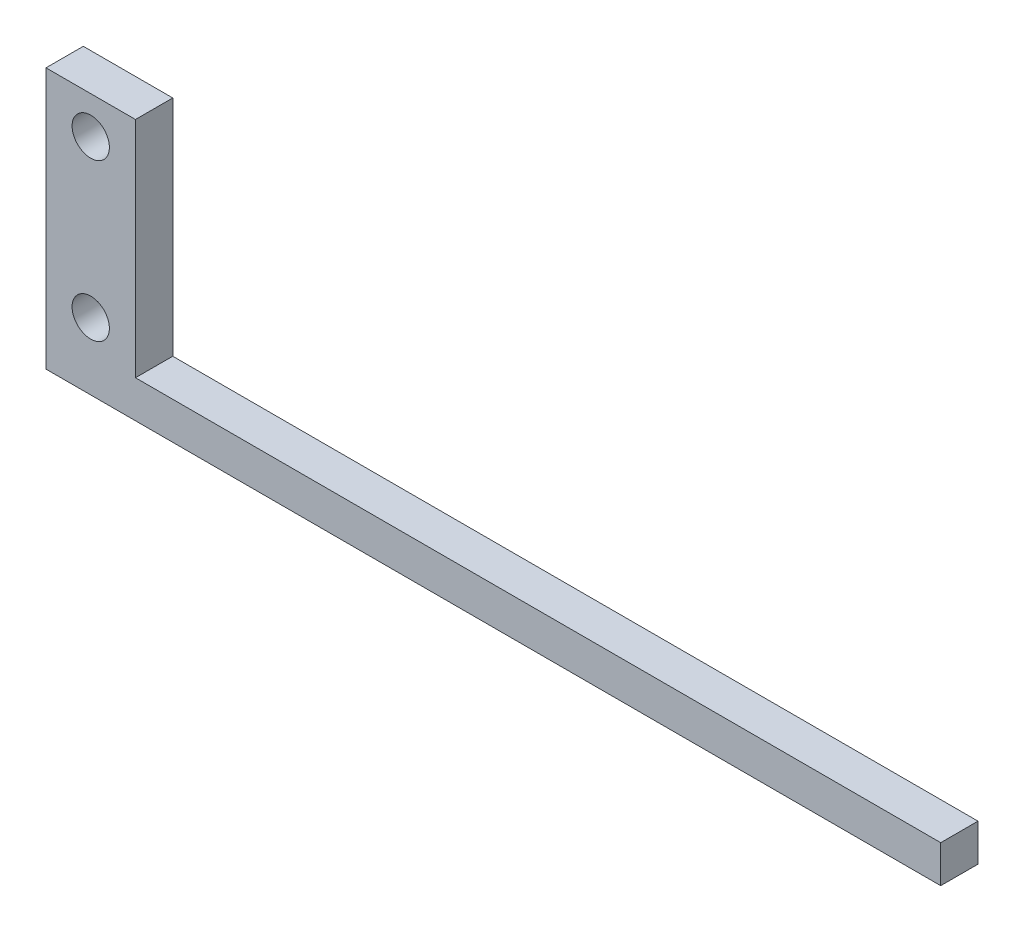
ISO-10303-21;
HEADER;
FILE_DESCRIPTION(('STEP AP214'),'2;1');
FILE_NAME('part.step','',(''),(''),'','','');
FILE_SCHEMA(('AUTOMOTIVE_DESIGN { 1 0 10303 214 1 1 1 1 }'));
ENDSEC;
DATA;
#1=APPLICATION_CONTEXT('core data for automotive mechanical design processes');
#2=APPLICATION_PROTOCOL_DEFINITION('international standard','automotive_design',2000,#1);
#3=PRODUCT_CONTEXT('',#1,'mechanical');
#4=PRODUCT('Part','Part','',(#3));
#5=PRODUCT_RELATED_PRODUCT_CATEGORY('part','',(#4));
#6=PRODUCT_DEFINITION_FORMATION('','',#4);
#7=PRODUCT_DEFINITION_CONTEXT('part definition',#1,'design');
#8=PRODUCT_DEFINITION('design','',#6,#7);
#9=PRODUCT_DEFINITION_SHAPE('','',#8);
#10=(LENGTH_UNIT() NAMED_UNIT(*) SI_UNIT(.MILLI.,.METRE.));
#11=(NAMED_UNIT(*) PLANE_ANGLE_UNIT() SI_UNIT($,.RADIAN.));
#12=(NAMED_UNIT(*) SI_UNIT($,.STERADIAN.) SOLID_ANGLE_UNIT());
#13=UNCERTAINTY_MEASURE_WITH_UNIT(LENGTH_MEASURE(1.E-05),#10,'distance_accuracy_value','');
#14=(GEOMETRIC_REPRESENTATION_CONTEXT(3) GLOBAL_UNCERTAINTY_ASSIGNED_CONTEXT((#13)) GLOBAL_UNIT_ASSIGNED_CONTEXT((#10,
#11,#12)) REPRESENTATION_CONTEXT('',''));
#15=CARTESIAN_POINT('',(0.,0.,0.));
#16=DIRECTION('',(0.,0.,1.));
#17=DIRECTION('',(1.,0.,0.));
#18=AXIS2_PLACEMENT_3D('',#15,#16,#17);
#19=CARTESIAN_POINT('',(137.16,0.,6.35));
#20=DIRECTION('',(0.,-1.,0.));
#21=DIRECTION('',(1.,0.,0.));
#22=AXIS2_PLACEMENT_3D('',#19,#20,#21);
#23=PLANE('',#22);
#24=DIRECTION('',(-1.,0.,0.));
#25=VECTOR('',#24,1.);
#26=CARTESIAN_POINT('',(137.16,0.,0.));
#27=LINE('',#26,#25);
#28=CARTESIAN_POINT('',(137.16,0.,0.));
#29=VERTEX_POINT('',#28);
#30=CARTESIAN_POINT('',(0.,0.,0.));
#31=VERTEX_POINT('',#30);
#32=EDGE_CURVE('E130',#29,#31,#27,.T.);
#33=ORIENTED_EDGE('',*,*,#32,.T.);
#34=DIRECTION('',(0.,0.,-1.));
#35=VECTOR('',#34,1.);
#36=CARTESIAN_POINT('',(0.,0.,6.35));
#37=LINE('',#36,#35);
#38=CARTESIAN_POINT('',(0.,0.,6.35));
#39=VERTEX_POINT('',#38);
#40=EDGE_CURVE('E13',#39,#31,#37,.T.);
#41=ORIENTED_EDGE('',*,*,#40,.F.);
#42=DIRECTION('',(-1.,0.,0.));
#43=VECTOR('',#42,1.);
#44=CARTESIAN_POINT('',(137.16,0.,6.35));
#45=LINE('',#44,#43);
#46=CARTESIAN_POINT('',(137.16,0.,6.35));
#47=VERTEX_POINT('',#46);
#48=EDGE_CURVE('E141',#47,#39,#45,.T.);
#49=ORIENTED_EDGE('',*,*,#48,.F.);
#50=DIRECTION('',(0.,0.,-1.));
#51=VECTOR('',#50,1.);
#52=CARTESIAN_POINT('',(137.16,0.,6.35));
#53=LINE('',#52,#51);
#54=EDGE_CURVE('E126',#47,#29,#53,.T.);
#55=ORIENTED_EDGE('',*,*,#54,.T.);
#56=EDGE_LOOP('',(#33,#41,#49,#55));
#57=FACE_BOUND('',#56,.T.);
#58=ADVANCED_FACE('F46',(#57),#23,.F.);
#59=CARTESIAN_POINT('',(0.,0.,6.35));
#60=DIRECTION('',(-1.,0.,0.));
#61=DIRECTION('',(0.,-1.,0.));
#62=AXIS2_PLACEMENT_3D('',#59,#60,#61);
#63=PLANE('',#62);
#64=DIRECTION('',(0.,1.,0.));
#65=VECTOR('',#64,1.);
#66=CARTESIAN_POINT('',(0.,0.,0.));
#67=LINE('',#66,#65);
#68=CARTESIAN_POINT('',(0.,38.1,0.));
#69=VERTEX_POINT('',#68);
#70=EDGE_CURVE('E133',#31,#69,#67,.T.);
#71=ORIENTED_EDGE('',*,*,#70,.T.);
#72=DIRECTION('',(0.,0.,-1.));
#73=VECTOR('',#72,1.);
#74=CARTESIAN_POINT('',(0.,38.1,6.35));
#75=LINE('',#74,#73);
#76=CARTESIAN_POINT('',(0.,38.1,6.35));
#77=VERTEX_POINT('',#76);
#78=EDGE_CURVE('E54',#77,#69,#75,.T.);
#79=ORIENTED_EDGE('',*,*,#78,.F.);
#80=DIRECTION('',(0.,1.,0.));
#81=VECTOR('',#80,1.);
#82=CARTESIAN_POINT('',(0.,0.,6.35));
#83=LINE('',#82,#81);
#84=EDGE_CURVE('E99',#39,#77,#83,.T.);
#85=ORIENTED_EDGE('',*,*,#84,.F.);
#86=ORIENTED_EDGE('',*,*,#40,.T.);
#87=EDGE_LOOP('',(#71,#79,#85,#86));
#88=FACE_BOUND('',#87,.T.);
#89=ADVANCED_FACE('F166',(#88),#63,.F.);
#90=CARTESIAN_POINT('',(0.,38.1,6.35));
#91=DIRECTION('',(0.,-1.,0.));
#92=DIRECTION('',(1.,0.,0.));
#93=AXIS2_PLACEMENT_3D('',#90,#91,#92);
#94=PLANE('',#93);
#95=DIRECTION('',(-1.,0.,0.));
#96=VECTOR('',#95,1.);
#97=CARTESIAN_POINT('',(0.,38.1,0.));
#98=LINE('',#97,#96);
#99=CARTESIAN_POINT('',(-15.24,38.1,0.));
#100=VERTEX_POINT('',#99);
#101=EDGE_CURVE('E136',#69,#100,#98,.T.);
#102=ORIENTED_EDGE('',*,*,#101,.T.);
#103=DIRECTION('',(0.,0.,-1.));
#104=VECTOR('',#103,1.);
#105=CARTESIAN_POINT('',(-15.24,38.1,6.35));
#106=LINE('',#105,#104);
#107=CARTESIAN_POINT('',(-15.24,38.1,6.35));
#108=VERTEX_POINT('',#107);
#109=EDGE_CURVE('E121',#108,#100,#106,.T.);
#110=ORIENTED_EDGE('',*,*,#109,.F.);
#111=DIRECTION('',(-1.,0.,0.));
#112=VECTOR('',#111,1.);
#113=CARTESIAN_POINT('',(0.,38.1,6.35));
#114=LINE('',#113,#112);
#115=EDGE_CURVE('E112',#77,#108,#114,.T.);
#116=ORIENTED_EDGE('',*,*,#115,.F.);
#117=ORIENTED_EDGE('',*,*,#78,.T.);
#118=EDGE_LOOP('',(#102,#110,#116,#117));
#119=FACE_BOUND('',#118,.T.);
#120=ADVANCED_FACE('F147',(#119),#94,.F.);
#121=CARTESIAN_POINT('',(-15.24,38.1,6.35));
#122=DIRECTION('',(1.,0.,0.));
#123=DIRECTION('',(0.,1.,0.));
#124=AXIS2_PLACEMENT_3D('',#121,#122,#123);
#125=PLANE('',#124);
#126=DIRECTION('',(0.,-1.,0.));
#127=VECTOR('',#126,1.);
#128=CARTESIAN_POINT('',(-15.24,38.1,0.));
#129=LINE('',#128,#127);
#130=CARTESIAN_POINT('',(-15.24,-6.34999999999997,0.));
#131=VERTEX_POINT('',#130);
#132=EDGE_CURVE('E120',#100,#131,#129,.T.);
#133=ORIENTED_EDGE('',*,*,#132,.T.);
#134=DIRECTION('',(0.,0.,-1.));
#135=VECTOR('',#134,1.);
#136=CARTESIAN_POINT('',(-15.24,-6.34999999999997,6.35));
#137=LINE('',#136,#135);
#138=CARTESIAN_POINT('',(-15.24,-6.34999999999997,6.35));
#139=VERTEX_POINT('',#138);
#140=EDGE_CURVE('E117',#139,#131,#137,.T.);
#141=ORIENTED_EDGE('',*,*,#140,.F.);
#142=DIRECTION('',(0.,-1.,0.));
#143=VECTOR('',#142,1.);
#144=CARTESIAN_POINT('',(-15.24,38.1,6.35));
#145=LINE('',#144,#143);
#146=EDGE_CURVE('E106',#108,#139,#145,.T.);
#147=ORIENTED_EDGE('',*,*,#146,.F.);
#148=ORIENTED_EDGE('',*,*,#109,.T.);
#149=EDGE_LOOP('',(#133,#141,#147,#148));
#150=FACE_BOUND('',#149,.T.);
#151=ADVANCED_FACE('F118',(#150),#125,.F.);
#152=CARTESIAN_POINT('',(-15.24,-6.34999999999997,6.35));
#153=DIRECTION('',(0.,1.,0.));
#154=DIRECTION('',(-1.,0.,0.));
#155=AXIS2_PLACEMENT_3D('',#152,#153,#154);
#156=PLANE('',#155);
#157=DIRECTION('',(1.,0.,0.));
#158=VECTOR('',#157,1.);
#159=CARTESIAN_POINT('',(-15.24,-6.34999999999997,0.));
#160=LINE('',#159,#158);
#161=CARTESIAN_POINT('',(137.16,-6.34999999999998,0.));
#162=VERTEX_POINT('',#161);
#163=EDGE_CURVE('E85',#131,#162,#160,.T.);
#164=ORIENTED_EDGE('',*,*,#163,.T.);
#165=DIRECTION('',(0.,0.,-1.));
#166=VECTOR('',#165,1.);
#167=CARTESIAN_POINT('',(137.16,-6.34999999999998,6.35));
#168=LINE('',#167,#166);
#169=CARTESIAN_POINT('',(137.16,-6.34999999999998,6.35));
#170=VERTEX_POINT('',#169);
#171=EDGE_CURVE('E122',#170,#162,#168,.T.);
#172=ORIENTED_EDGE('',*,*,#171,.F.);
#173=DIRECTION('',(1.,0.,0.));
#174=VECTOR('',#173,1.);
#175=CARTESIAN_POINT('',(-15.24,-6.34999999999997,6.35));
#176=LINE('',#175,#174);
#177=EDGE_CURVE('E110',#139,#170,#176,.T.);
#178=ORIENTED_EDGE('',*,*,#177,.F.);
#179=ORIENTED_EDGE('',*,*,#140,.T.);
#180=EDGE_LOOP('',(#164,#172,#178,#179));
#181=FACE_BOUND('',#180,.T.);
#182=ADVANCED_FACE('F124',(#181),#156,.F.);
#183=CARTESIAN_POINT('',(137.16,-6.34999999999998,6.35));
#184=DIRECTION('',(-1.,0.,0.));
#185=DIRECTION('',(0.,0.,1.));
#186=AXIS2_PLACEMENT_3D('',#183,#184,#185);
#187=PLANE('',#186);
#188=DIRECTION('',(0.,1.,0.));
#189=VECTOR('',#188,1.);
#190=CARTESIAN_POINT('',(137.16,-6.34999999999998,0.));
#191=LINE('',#190,#189);
#192=EDGE_CURVE('E91',#162,#29,#191,.T.);
#193=ORIENTED_EDGE('',*,*,#192,.T.);
#194=ORIENTED_EDGE('',*,*,#54,.F.);
#195=DIRECTION('',(0.,1.,0.));
#196=VECTOR('',#195,1.);
#197=CARTESIAN_POINT('',(137.16,-6.34999999999998,6.35));
#198=LINE('',#197,#196);
#199=EDGE_CURVE('E62',#170,#47,#198,.T.);
#200=ORIENTED_EDGE('',*,*,#199,.F.);
#201=ORIENTED_EDGE('',*,*,#171,.T.);
#202=EDGE_LOOP('',(#193,#194,#200,#201));
#203=FACE_BOUND('',#202,.T.);
#204=ADVANCED_FACE('F154',(#203),#187,.F.);
#205=CARTESIAN_POINT('',(0.,0.,6.35));
#206=DIRECTION('',(0.,0.,-1.));
#207=DIRECTION('',(-1.,0.,0.));
#208=AXIS2_PLACEMENT_3D('',#205,#206,#207);
#209=PLANE('',#208);
#210=CARTESIAN_POINT('',(-7.62,31.75,6.35));
#211=DIRECTION('',(0.,0.,-1.));
#212=DIRECTION('',(-1.,0.,0.));
#213=AXIS2_PLACEMENT_3D('',#210,#211,#212);
#214=CIRCLE('',#213,3.175);
#215=CARTESIAN_POINT('',(-10.795,31.75,6.35));
#216=VERTEX_POINT('',#215);
#217=EDGE_CURVE('E229',#216,#216,#214,.T.);
#218=ORIENTED_EDGE('',*,*,#217,.T.);
#219=EDGE_LOOP('',(#218));
#220=FACE_BOUND('',#219,.T.);
#221=CARTESIAN_POINT('',(-7.62,5.06071404612385,6.35));
#222=DIRECTION('',(0.,0.,-1.));
#223=DIRECTION('',(-1.,0.,0.));
#224=AXIS2_PLACEMENT_3D('',#221,#222,#223);
#225=CIRCLE('',#224,3.175);
#226=CARTESIAN_POINT('',(-10.795,5.06071404612385,6.35));
#227=VERTEX_POINT('',#226);
#228=EDGE_CURVE('E134',#227,#227,#225,.T.);
#229=ORIENTED_EDGE('',*,*,#228,.T.);
#230=EDGE_LOOP('',(#229));
#231=FACE_BOUND('',#230,.T.);
#232=ORIENTED_EDGE('',*,*,#48,.T.);
#233=ORIENTED_EDGE('',*,*,#84,.T.);
#234=ORIENTED_EDGE('',*,*,#115,.T.);
#235=ORIENTED_EDGE('',*,*,#146,.T.);
#236=ORIENTED_EDGE('',*,*,#177,.T.);
#237=ORIENTED_EDGE('',*,*,#199,.T.);
#238=EDGE_LOOP('',(#232,#233,#234,#235,#236,#237));
#239=FACE_BOUND('',#238,.T.);
#240=ADVANCED_FACE('F108',(#220,#231,#239),#209,.F.);
#241=CARTESIAN_POINT('',(0.,0.,0.));
#242=DIRECTION('',(0.,0.,-1.));
#243=DIRECTION('',(-1.,0.,0.));
#244=AXIS2_PLACEMENT_3D('',#241,#242,#243);
#245=PLANE('',#244);
#246=CARTESIAN_POINT('',(-7.62,31.75,0.));
#247=DIRECTION('',(0.,0.,-1.));
#248=DIRECTION('',(-1.,0.,0.));
#249=AXIS2_PLACEMENT_3D('',#246,#247,#248);
#250=CIRCLE('',#249,3.175);
#251=CARTESIAN_POINT('',(-10.795,31.75,0.));
#252=VERTEX_POINT('',#251);
#253=EDGE_CURVE('E232',#252,#252,#250,.T.);
#254=ORIENTED_EDGE('',*,*,#253,.F.);
#255=EDGE_LOOP('',(#254));
#256=FACE_BOUND('',#255,.T.);
#257=CARTESIAN_POINT('',(-7.62,5.06071404612385,0.));
#258=DIRECTION('',(0.,0.,-1.));
#259=DIRECTION('',(-1.,0.,0.));
#260=AXIS2_PLACEMENT_3D('',#257,#258,#259);
#261=CIRCLE('',#260,3.175);
#262=CARTESIAN_POINT('',(-10.795,5.06071404612385,0.));
#263=VERTEX_POINT('',#262);
#264=EDGE_CURVE('E234',#263,#263,#261,.T.);
#265=ORIENTED_EDGE('',*,*,#264,.F.);
#266=EDGE_LOOP('',(#265));
#267=FACE_BOUND('',#266,.T.);
#268=ORIENTED_EDGE('',*,*,#32,.F.);
#269=ORIENTED_EDGE('',*,*,#192,.F.);
#270=ORIENTED_EDGE('',*,*,#163,.F.);
#271=ORIENTED_EDGE('',*,*,#132,.F.);
#272=ORIENTED_EDGE('',*,*,#101,.F.);
#273=ORIENTED_EDGE('',*,*,#70,.F.);
#274=EDGE_LOOP('',(#268,#269,#270,#271,#272,#273));
#275=FACE_BOUND('',#274,.T.);
#276=ADVANCED_FACE('F150',(#256,#267,#275),#245,.T.);
#277=CARTESIAN_POINT('',(-7.62,5.06071404612385,0.));
#278=DIRECTION('',(0.,0.,-1.));
#279=DIRECTION('',(-1.,0.,0.));
#280=AXIS2_PLACEMENT_3D('',#277,#278,#279);
#281=CYLINDRICAL_SURFACE('',#280,3.175);
#282=ORIENTED_EDGE('',*,*,#228,.F.);
#283=EDGE_LOOP('',(#282));
#284=FACE_BOUND('',#283,.T.);
#285=ORIENTED_EDGE('',*,*,#264,.T.);
#286=EDGE_LOOP('',(#285));
#287=FACE_BOUND('',#286,.T.);
#288=ADVANCED_FACE('F203',(#284,#287),#281,.F.);
#289=CARTESIAN_POINT('',(-7.62,31.75,0.));
#290=DIRECTION('',(0.,0.,-1.));
#291=DIRECTION('',(-1.,0.,0.));
#292=AXIS2_PLACEMENT_3D('',#289,#290,#291);
#293=CYLINDRICAL_SURFACE('',#292,3.175);
#294=ORIENTED_EDGE('',*,*,#217,.F.);
#295=EDGE_LOOP('',(#294));
#296=FACE_BOUND('',#295,.T.);
#297=ORIENTED_EDGE('',*,*,#253,.T.);
#298=EDGE_LOOP('',(#297));
#299=FACE_BOUND('',#298,.T.);
#300=ADVANCED_FACE('F212',(#296,#299),#293,.F.);
#301=CLOSED_SHELL('',(#58,#89,#120,#151,#182,#204,#240,#276,#288,#300));
#302=MANIFOLD_SOLID_BREP('B2',#301);
#303=ADVANCED_BREP_SHAPE_REPRESENTATION('',(#18,#302),#14);
#304=SHAPE_DEFINITION_REPRESENTATION(#9,#303);
ENDSEC;
END-ISO-10303-21;
